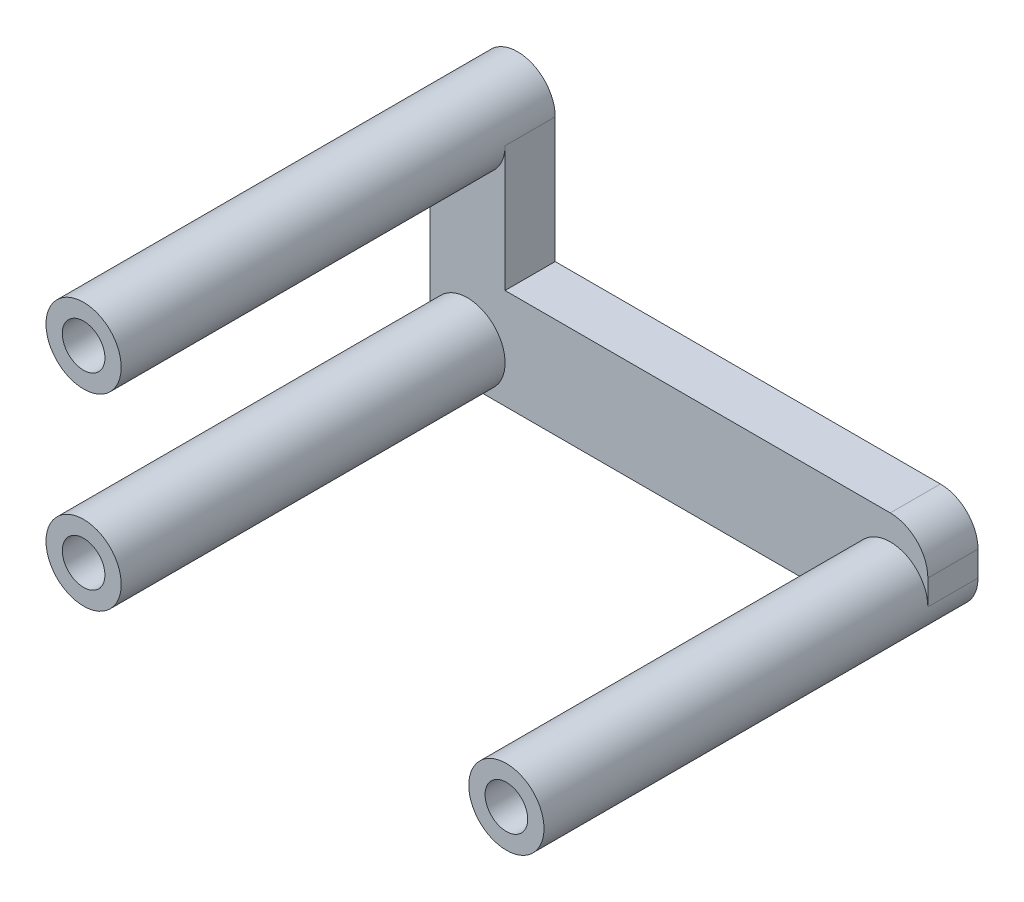
ISO-10303-21;
HEADER;
FILE_DESCRIPTION(('STEP AP214'),'2;1');
FILE_NAME('part.step','',(''),(''),'','','');
FILE_SCHEMA(('AUTOMOTIVE_DESIGN { 1 0 10303 214 1 1 1 1 }'));
ENDSEC;
DATA;
#1=APPLICATION_CONTEXT('core data for automotive mechanical design processes');
#2=APPLICATION_PROTOCOL_DEFINITION('international standard','automotive_design',2000,#1);
#3=PRODUCT_CONTEXT('',#1,'mechanical');
#4=PRODUCT('Part','Part','',(#3));
#5=PRODUCT_RELATED_PRODUCT_CATEGORY('part','',(#4));
#6=PRODUCT_DEFINITION_FORMATION('','',#4);
#7=PRODUCT_DEFINITION_CONTEXT('part definition',#1,'design');
#8=PRODUCT_DEFINITION('design','',#6,#7);
#9=PRODUCT_DEFINITION_SHAPE('','',#8);
#10=(LENGTH_UNIT() NAMED_UNIT(*) SI_UNIT(.MILLI.,.METRE.));
#11=(NAMED_UNIT(*) PLANE_ANGLE_UNIT() SI_UNIT($,.RADIAN.));
#12=(NAMED_UNIT(*) SI_UNIT($,.STERADIAN.) SOLID_ANGLE_UNIT());
#13=UNCERTAINTY_MEASURE_WITH_UNIT(LENGTH_MEASURE(1.E-05),#10,'distance_accuracy_value','');
#14=(GEOMETRIC_REPRESENTATION_CONTEXT(3) GLOBAL_UNCERTAINTY_ASSIGNED_CONTEXT((#13)) GLOBAL_UNIT_ASSIGNED_CONTEXT((#10,
#11,#12)) REPRESENTATION_CONTEXT('',''));
#15=CARTESIAN_POINT('',(0.,0.,0.));
#16=DIRECTION('',(0.,0.,1.));
#17=DIRECTION('',(1.,0.,0.));
#18=AXIS2_PLACEMENT_3D('',#15,#16,#17);
#19=CARTESIAN_POINT('',(-26.7334060127715,18.161,44.1104813742433));
#20=DIRECTION('',(0.,0.,-1.));
#21=DIRECTION('',(-1.,0.,0.));
#22=AXIS2_PLACEMENT_3D('',#19,#20,#21);
#23=CYLINDRICAL_SURFACE('',#22,2.99999999999983);
#24=CARTESIAN_POINT('',(-26.7334060127715,18.161,35.6252000000052));
#25=DIRECTION('',(0.,0.,-1.));
#26=DIRECTION('',(0.,1.,0.));
#27=AXIS2_PLACEMENT_3D('',#24,#25,#26);
#28=CIRCLE('',#27,2.99999999999983);
#29=CARTESIAN_POINT('',(-26.7334060127715,21.1609999999998,35.6252000000052));
#30=VERTEX_POINT('',#29);
#31=EDGE_CURVE('E137',#30,#30,#28,.F.);
#32=ORIENTED_EDGE('',*,*,#31,.F.);
#33=EDGE_LOOP('',(#32));
#34=FACE_BOUND('',#33,.T.);
#35=CARTESIAN_POINT('',(-26.7334060127715,18.161,5.));
#36=DIRECTION('',(0.,0.,-1.));
#37=DIRECTION('',(-1.,0.,0.));
#38=AXIS2_PLACEMENT_3D('',#35,#36,#37);
#39=CIRCLE('',#38,2.99999999999983);
#40=CARTESIAN_POINT('',(-29.7334060127713,18.161,5.));
#41=VERTEX_POINT('',#40);
#42=CARTESIAN_POINT('',(-26.7334060127715,15.1610000000002,5.));
#43=VERTEX_POINT('',#42);
#44=EDGE_CURVE('E140',#41,#43,#39,.T.);
#45=ORIENTED_EDGE('',*,*,#44,.F.);
#46=DIRECTION('',(0.,0.,1.));
#47=VECTOR('',#46,1.);
#48=CARTESIAN_POINT('',(-29.7334060127713,18.161,-15.1554944214034));
#49=LINE('',#48,#47);
#50=CARTESIAN_POINT('',(-29.7334060127713,18.161,1.));
#51=VERTEX_POINT('',#50);
#52=EDGE_CURVE('E203',#51,#41,#49,.T.);
#53=ORIENTED_EDGE('',*,*,#52,.F.);
#54=CARTESIAN_POINT('',(-26.7334060127715,18.161,1.));
#55=DIRECTION('',(0.,0.,-1.));
#56=DIRECTION('',(-1.,0.,0.));
#57=AXIS2_PLACEMENT_3D('',#54,#55,#56);
#58=CIRCLE('',#57,2.99999999999984);
#59=CARTESIAN_POINT('',(-26.7334060127715,15.1610000000002,1.));
#60=VERTEX_POINT('',#59);
#61=EDGE_CURVE('E146',#51,#60,#58,.F.);
#62=ORIENTED_EDGE('',*,*,#61,.T.);
#63=DIRECTION('',(0.,0.,1.));
#64=VECTOR('',#63,1.);
#65=CARTESIAN_POINT('',(-26.7334060127715,15.1610000000002,0.));
#66=LINE('',#65,#64);
#67=EDGE_CURVE('E126',#60,#43,#66,.T.);
#68=ORIENTED_EDGE('',*,*,#67,.T.);
#69=EDGE_LOOP('',(#45,#53,#62,#68));
#70=FACE_BOUND('',#69,.T.);
#71=ADVANCED_FACE('F37',(#34,#70),#23,.T.);
#72=CARTESIAN_POINT('',(9.99690566934757,15.1610000000002,5.));
#73=DIRECTION('',(0.,1.,0.));
#74=DIRECTION('',(-1.,0.,0.));
#75=AXIS2_PLACEMENT_3D('',#72,#73,#74);
#76=PLANE('',#75);
#77=DIRECTION('',(1.,0.,0.));
#78=VECTOR('',#77,1.);
#79=CARTESIAN_POINT('',(9.99690566934757,15.1610000000002,5.));
#80=LINE('',#79,#78);
#81=CARTESIAN_POINT('',(6.99690566934774,15.1610000000002,5.));
#82=VERTEX_POINT('',#81);
#83=EDGE_CURVE('E143',#43,#82,#80,.T.);
#84=ORIENTED_EDGE('',*,*,#83,.F.);
#85=ORIENTED_EDGE('',*,*,#67,.F.);
#86=DIRECTION('',(1.,0.,0.));
#87=VECTOR('',#86,1.);
#88=CARTESIAN_POINT('',(9.99690566934757,15.1610000000002,1.));
#89=LINE('',#88,#87);
#90=CARTESIAN_POINT('',(6.99690566934774,15.1610000000002,1.));
#91=VERTEX_POINT('',#90);
#92=EDGE_CURVE('E142',#60,#91,#89,.T.);
#93=ORIENTED_EDGE('',*,*,#92,.T.);
#94=DIRECTION('',(0.,0.,1.));
#95=VECTOR('',#94,1.);
#96=CARTESIAN_POINT('',(6.99690566934774,15.1610000000002,0.));
#97=LINE('',#96,#95);
#98=EDGE_CURVE('E124',#82,#91,#97,.F.);
#99=ORIENTED_EDGE('',*,*,#98,.F.);
#100=EDGE_LOOP('',(#84,#85,#93,#99));
#101=FACE_BOUND('',#100,.T.);
#102=ADVANCED_FACE('F264',(#101),#76,.F.);
#103=CARTESIAN_POINT('',(0.,0.,5.));
#104=DIRECTION('',(0.,0.,-1.));
#105=DIRECTION('',(-1.,0.,0.));
#106=AXIS2_PLACEMENT_3D('',#103,#104,#105);
#107=PLANE('',#106);
#108=DIRECTION('',(0.,1.,0.));
#109=VECTOR('',#108,1.);
#110=CARTESIAN_POINT('',(9.99690566934757,18.161,5.));
#111=LINE('',#110,#109);
#112=CARTESIAN_POINT('',(9.99690566934757,18.161,5.));
#113=VERTEX_POINT('',#112);
#114=CARTESIAN_POINT('',(9.99690566934757,20.1609999999998,5.));
#115=VERTEX_POINT('',#114);
#116=EDGE_CURVE('E116',#113,#115,#111,.T.);
#117=ORIENTED_EDGE('',*,*,#116,.T.);
#118=CARTESIAN_POINT('',(6.99690566934757,20.1609999999998,5.));
#119=DIRECTION('',(0.,0.,-1.));
#120=DIRECTION('',(-1.,0.,0.));
#121=AXIS2_PLACEMENT_3D('',#118,#119,#120);
#122=CIRCLE('',#121,3.);
#123=CARTESIAN_POINT('',(6.99690566934757,23.1609999999998,5.));
#124=VERTEX_POINT('',#123);
#125=EDGE_CURVE('E11',#115,#124,#122,.F.);
#126=ORIENTED_EDGE('',*,*,#125,.T.);
#127=DIRECTION('',(-1.,0.,0.));
#128=VECTOR('',#127,1.);
#129=CARTESIAN_POINT('',(9.99690566934757,23.1609999999998,5.));
#130=LINE('',#129,#128);
#131=CARTESIAN_POINT('',(-23.7334060127716,23.1609999999998,5.));
#132=VERTEX_POINT('',#131);
#133=EDGE_CURVE('E160',#124,#132,#130,.T.);
#134=ORIENTED_EDGE('',*,*,#133,.T.);
#135=DIRECTION('',(0.,1.,0.));
#136=VECTOR('',#135,1.);
#137=CARTESIAN_POINT('',(-23.7334060127716,33.161,5.));
#138=LINE('',#137,#136);
#139=CARTESIAN_POINT('',(-23.7334060127716,33.161,5.));
#140=VERTEX_POINT('',#139);
#141=EDGE_CURVE('E196',#132,#140,#138,.T.);
#142=ORIENTED_EDGE('',*,*,#141,.T.);
#143=CARTESIAN_POINT('',(-26.7334060127715,33.161,5.));
#144=DIRECTION('',(0.,0.,-1.));
#145=DIRECTION('',(-1.,0.,0.));
#146=AXIS2_PLACEMENT_3D('',#143,#144,#145);
#147=CIRCLE('',#146,2.99999999999983);
#148=CARTESIAN_POINT('',(-29.7334060127713,33.161,5.));
#149=VERTEX_POINT('',#148);
#150=EDGE_CURVE('E193',#140,#149,#147,.T.);
#151=ORIENTED_EDGE('',*,*,#150,.T.);
#152=DIRECTION('',(0.,-1.,0.));
#153=VECTOR('',#152,1.);
#154=CARTESIAN_POINT('',(-29.7334060127713,33.161,5.));
#155=LINE('',#154,#153);
#156=EDGE_CURVE('E197',#149,#41,#155,.T.);
#157=ORIENTED_EDGE('',*,*,#156,.T.);
#158=ORIENTED_EDGE('',*,*,#44,.T.);
#159=ORIENTED_EDGE('',*,*,#83,.T.);
#160=CARTESIAN_POINT('',(6.99690566934774,18.161,5.));
#161=DIRECTION('',(0.,0.,-1.));
#162=DIRECTION('',(-1.,0.,0.));
#163=AXIS2_PLACEMENT_3D('',#160,#161,#162);
#164=CIRCLE('',#163,2.99999999999983);
#165=EDGE_CURVE('E129',#82,#113,#164,.T.);
#166=ORIENTED_EDGE('',*,*,#165,.T.);
#167=EDGE_LOOP('',(#117,#126,#134,#142,#151,#157,#158,#159,#166));
#168=FACE_BOUND('',#167,.T.);
#169=ADVANCED_FACE('F221',(#168),#107,.F.);
#170=CARTESIAN_POINT('',(0.,0.,1.));
#171=DIRECTION('',(0.,0.,-1.));
#172=DIRECTION('',(-1.,0.,0.));
#173=AXIS2_PLACEMENT_3D('',#170,#171,#172);
#174=PLANE('',#173);
#175=CARTESIAN_POINT('',(5.4590000000791,20.161,1.));
#176=DIRECTION('',(0.,0.,-1.));
#177=DIRECTION('',(-1.,0.,0.));
#178=AXIS2_PLACEMENT_3D('',#175,#176,#177);
#179=CIRCLE('',#178,1.70000000007498);
#180=CARTESIAN_POINT('',(3.75900000000413,20.161,1.));
#181=VERTEX_POINT('',#180);
#182=EDGE_CURVE('E230',#181,#181,#179,.T.);
#183=ORIENTED_EDGE('',*,*,#182,.F.);
#184=EDGE_LOOP('',(#183));
#185=FACE_BOUND('',#184,.T.);
#186=CARTESIAN_POINT('',(-15.621,20.161,1.));
#187=DIRECTION('',(0.,0.,-1.));
#188=DIRECTION('',(-1.,0.,0.));
#189=AXIS2_PLACEMENT_3D('',#186,#187,#188);
#190=CIRCLE('',#189,1.7);
#191=CARTESIAN_POINT('',(-17.321,20.161,1.));
#192=VERTEX_POINT('',#191);
#193=EDGE_CURVE('E227',#192,#192,#190,.T.);
#194=ORIENTED_EDGE('',*,*,#193,.F.);
#195=EDGE_LOOP('',(#194));
#196=FACE_BOUND('',#195,.T.);
#197=DIRECTION('',(1.,0.,0.));
#198=VECTOR('',#197,1.);
#199=CARTESIAN_POINT('',(9.99690566934757,23.1609999999998,1.));
#200=LINE('',#199,#198);
#201=CARTESIAN_POINT('',(-23.7334060127716,23.1609999999998,1.));
#202=VERTEX_POINT('',#201);
#203=CARTESIAN_POINT('',(6.99690566934757,23.1609999999998,1.));
#204=VERTEX_POINT('',#203);
#205=EDGE_CURVE('E110',#202,#204,#200,.T.);
#206=ORIENTED_EDGE('',*,*,#205,.T.);
#207=CARTESIAN_POINT('',(6.99690566934757,20.1609999999998,1.));
#208=DIRECTION('',(0.,0.,-1.));
#209=DIRECTION('',(-1.,0.,0.));
#210=AXIS2_PLACEMENT_3D('',#207,#208,#209);
#211=CIRCLE('',#210,3.);
#212=CARTESIAN_POINT('',(9.99690566934757,20.1609999999998,1.));
#213=VERTEX_POINT('',#212);
#214=EDGE_CURVE('E59',#204,#213,#211,.T.);
#215=ORIENTED_EDGE('',*,*,#214,.T.);
#216=DIRECTION('',(0.,-1.,0.));
#217=VECTOR('',#216,1.);
#218=CARTESIAN_POINT('',(9.99690566934757,18.161,1.));
#219=LINE('',#218,#217);
#220=CARTESIAN_POINT('',(9.99690566934757,18.161,1.));
#221=VERTEX_POINT('',#220);
#222=EDGE_CURVE('E105',#213,#221,#219,.T.);
#223=ORIENTED_EDGE('',*,*,#222,.T.);
#224=CARTESIAN_POINT('',(6.99690566934774,18.161,1.));
#225=DIRECTION('',(0.,0.,-1.));
#226=DIRECTION('',(-1.,0.,0.));
#227=AXIS2_PLACEMENT_3D('',#224,#225,#226);
#228=CIRCLE('',#227,2.99999999999983);
#229=EDGE_CURVE('E109',#91,#221,#228,.F.);
#230=ORIENTED_EDGE('',*,*,#229,.F.);
#231=ORIENTED_EDGE('',*,*,#92,.F.);
#232=ORIENTED_EDGE('',*,*,#61,.F.);
#233=DIRECTION('',(0.,-1.,0.));
#234=VECTOR('',#233,1.);
#235=CARTESIAN_POINT('',(-29.7334060127713,33.161,1.));
#236=LINE('',#235,#234);
#237=CARTESIAN_POINT('',(-29.7334060127713,33.161,1.));
#238=VERTEX_POINT('',#237);
#239=EDGE_CURVE('E204',#238,#51,#236,.T.);
#240=ORIENTED_EDGE('',*,*,#239,.F.);
#241=CARTESIAN_POINT('',(-26.7334060127715,33.161,1.));
#242=DIRECTION('',(0.,0.,-1.));
#243=DIRECTION('',(-1.,0.,0.));
#244=AXIS2_PLACEMENT_3D('',#241,#242,#243);
#245=CIRCLE('',#244,2.99999999999983);
#246=CARTESIAN_POINT('',(-23.7334060127716,33.161,1.));
#247=VERTEX_POINT('',#246);
#248=EDGE_CURVE('E191',#238,#247,#245,.T.);
#249=ORIENTED_EDGE('',*,*,#248,.T.);
#250=DIRECTION('',(0.,1.,0.));
#251=VECTOR('',#250,1.);
#252=CARTESIAN_POINT('',(-23.7334060127716,33.161,1.));
#253=LINE('',#252,#251);
#254=EDGE_CURVE('E165',#202,#247,#253,.T.);
#255=ORIENTED_EDGE('',*,*,#254,.F.);
#256=EDGE_LOOP('',(#206,#215,#223,#230,#231,#232,#240,#249,#255));
#257=FACE_BOUND('',#256,.T.);
#258=ADVANCED_FACE('F107',(#185,#196,#257),#174,.T.);
#259=CARTESIAN_POINT('',(-11.1849999999844,-42.5500000000817,35.625200000005));
#260=DIRECTION('',(0.,0.,-1.));
#261=DIRECTION('',(1.,0.,0.));
#262=AXIS2_PLACEMENT_3D('',#259,#260,#261);
#263=PLANE('',#262);
#264=CARTESIAN_POINT('',(-26.7334060127715,18.161,35.6252000000051));
#265=DIRECTION('',(0.,0.,1.));
#266=DIRECTION('',(-1.,0.,0.));
#267=AXIS2_PLACEMENT_3D('',#264,#265,#266);
#268=CIRCLE('',#267,1.7);
#269=CARTESIAN_POINT('',(-28.4334060127715,18.161,35.6252000000051));
#270=VERTEX_POINT('',#269);
#271=EDGE_CURVE('E177',#270,#270,#268,.T.);
#272=ORIENTED_EDGE('',*,*,#271,.F.);
#273=EDGE_LOOP('',(#272));
#274=FACE_BOUND('',#273,.T.);
#275=ORIENTED_EDGE('',*,*,#31,.T.);
#276=EDGE_LOOP('',(#275));
#277=FACE_BOUND('',#276,.T.);
#278=ADVANCED_FACE('F247',(#274,#277),#263,.F.);
#279=CARTESIAN_POINT('',(6.99690566934774,18.161,44.1104813742433));
#280=DIRECTION('',(0.,0.,-1.));
#281=DIRECTION('',(-1.,0.,0.));
#282=AXIS2_PLACEMENT_3D('',#279,#280,#281);
#283=CYLINDRICAL_SURFACE('',#282,2.99999999999983);
#284=DIRECTION('',(0.,0.,-1.));
#285=VECTOR('',#284,1.);
#286=CARTESIAN_POINT('',(9.99690566934757,18.161,39.0988845297453));
#287=LINE('',#286,#285);
#288=EDGE_CURVE('E114',#113,#221,#287,.T.);
#289=ORIENTED_EDGE('',*,*,#288,.F.);
#290=ORIENTED_EDGE('',*,*,#165,.F.);
#291=ORIENTED_EDGE('',*,*,#98,.T.);
#292=ORIENTED_EDGE('',*,*,#229,.T.);
#293=EDGE_LOOP('',(#289,#290,#291,#292));
#294=FACE_BOUND('',#293,.T.);
#295=CARTESIAN_POINT('',(6.99690566934774,18.161,35.6252000000052));
#296=DIRECTION('',(0.,0.,-1.));
#297=DIRECTION('',(0.,1.,0.));
#298=AXIS2_PLACEMENT_3D('',#295,#296,#297);
#299=CIRCLE('',#298,2.99999999999983);
#300=CARTESIAN_POINT('',(6.99690566934774,21.1609999999998,35.6252000000052));
#301=VERTEX_POINT('',#300);
#302=EDGE_CURVE('E125',#301,#301,#299,.F.);
#303=ORIENTED_EDGE('',*,*,#302,.F.);
#304=EDGE_LOOP('',(#303));
#305=FACE_BOUND('',#304,.T.);
#306=ADVANCED_FACE('F122',(#294,#305),#283,.T.);
#307=CARTESIAN_POINT('',(-11.1849999999844,-42.5500000000817,35.625200000005));
#308=DIRECTION('',(0.,0.,-1.));
#309=DIRECTION('',(1.,0.,0.));
#310=AXIS2_PLACEMENT_3D('',#307,#308,#309);
#311=PLANE('',#310);
#312=CARTESIAN_POINT('',(6.99690566934774,18.161,35.6252000000051));
#313=DIRECTION('',(0.,0.,1.));
#314=DIRECTION('',(-1.,0.,0.));
#315=AXIS2_PLACEMENT_3D('',#312,#313,#314);
#316=CIRCLE('',#315,1.7);
#317=CARTESIAN_POINT('',(5.29690566934774,18.161,35.6252000000051));
#318=VERTEX_POINT('',#317);
#319=EDGE_CURVE('E183',#318,#318,#316,.T.);
#320=ORIENTED_EDGE('',*,*,#319,.F.);
#321=EDGE_LOOP('',(#320));
#322=FACE_BOUND('',#321,.T.);
#323=ORIENTED_EDGE('',*,*,#302,.T.);
#324=EDGE_LOOP('',(#323));
#325=FACE_BOUND('',#324,.T.);
#326=ADVANCED_FACE('F301',(#322,#325),#311,.F.);
#327=CARTESIAN_POINT('',(-23.7334060127716,33.161,-15.1554944214034));
#328=DIRECTION('',(1.,0.,0.));
#329=DIRECTION('',(0.,1.,0.));
#330=AXIS2_PLACEMENT_3D('',#327,#328,#329);
#331=PLANE('',#330);
#332=DIRECTION('',(0.,0.,-1.));
#333=VECTOR('',#332,1.);
#334=CARTESIAN_POINT('',(-23.7334060127716,23.1609999999998,39.0988845297453));
#335=LINE('',#334,#333);
#336=EDGE_CURVE('E119',#132,#202,#335,.T.);
#337=ORIENTED_EDGE('',*,*,#336,.T.);
#338=ORIENTED_EDGE('',*,*,#254,.T.);
#339=DIRECTION('',(0.,0.,1.));
#340=VECTOR('',#339,1.);
#341=CARTESIAN_POINT('',(-23.7334060127716,33.161,-15.1554944214034));
#342=LINE('',#341,#340);
#343=EDGE_CURVE('E132',#247,#140,#342,.T.);
#344=ORIENTED_EDGE('',*,*,#343,.T.);
#345=ORIENTED_EDGE('',*,*,#141,.F.);
#346=EDGE_LOOP('',(#337,#338,#344,#345));
#347=FACE_BOUND('',#346,.T.);
#348=ADVANCED_FACE('F215',(#347),#331,.T.);
#349=CARTESIAN_POINT('',(-29.7334060127713,33.161,-15.1554944214034));
#350=DIRECTION('',(-1.,0.,0.));
#351=DIRECTION('',(0.,-1.,0.));
#352=AXIS2_PLACEMENT_3D('',#349,#350,#351);
#353=PLANE('',#352);
#354=DIRECTION('',(0.,0.,1.));
#355=VECTOR('',#354,1.);
#356=CARTESIAN_POINT('',(-29.7334060127713,33.161,-15.1554944214034));
#357=LINE('',#356,#355);
#358=EDGE_CURVE('E200',#238,#149,#357,.T.);
#359=ORIENTED_EDGE('',*,*,#358,.F.);
#360=ORIENTED_EDGE('',*,*,#239,.T.);
#361=ORIENTED_EDGE('',*,*,#52,.T.);
#362=ORIENTED_EDGE('',*,*,#156,.F.);
#363=EDGE_LOOP('',(#359,#360,#361,#362));
#364=FACE_BOUND('',#363,.T.);
#365=ADVANCED_FACE('F314',(#364),#353,.T.);
#366=CARTESIAN_POINT('',(-26.7334060127715,33.161,44.1104813742433));
#367=DIRECTION('',(0.,0.,-1.));
#368=DIRECTION('',(-1.,0.,0.));
#369=AXIS2_PLACEMENT_3D('',#366,#367,#368);
#370=CYLINDRICAL_SURFACE('',#369,2.99999999999983);
#371=CARTESIAN_POINT('',(-26.7334060127715,33.161,35.6252000000052));
#372=DIRECTION('',(0.,0.,-1.));
#373=DIRECTION('',(0.,1.,0.));
#374=AXIS2_PLACEMENT_3D('',#371,#372,#373);
#375=CIRCLE('',#374,2.99999999999983);
#376=CARTESIAN_POINT('',(-26.7334060127715,36.1609999999998,35.6252000000052));
#377=VERTEX_POINT('',#376);
#378=EDGE_CURVE('E173',#377,#377,#375,.F.);
#379=ORIENTED_EDGE('',*,*,#378,.F.);
#380=EDGE_LOOP('',(#379));
#381=FACE_BOUND('',#380,.T.);
#382=ORIENTED_EDGE('',*,*,#150,.F.);
#383=ORIENTED_EDGE('',*,*,#343,.F.);
#384=ORIENTED_EDGE('',*,*,#248,.F.);
#385=ORIENTED_EDGE('',*,*,#358,.T.);
#386=EDGE_LOOP('',(#382,#383,#384,#385));
#387=FACE_BOUND('',#386,.T.);
#388=ADVANCED_FACE('F218',(#381,#387),#370,.T.);
#389=CARTESIAN_POINT('',(-11.1849999999844,-42.5500000000817,35.625200000005));
#390=DIRECTION('',(0.,0.,-1.));
#391=DIRECTION('',(1.,0.,0.));
#392=AXIS2_PLACEMENT_3D('',#389,#390,#391);
#393=PLANE('',#392);
#394=CARTESIAN_POINT('',(-26.7334060127715,33.161,35.6252000000051));
#395=DIRECTION('',(0.,0.,1.));
#396=DIRECTION('',(1.,0.,0.));
#397=AXIS2_PLACEMENT_3D('',#394,#395,#396);
#398=CIRCLE('',#397,1.7);
#399=CARTESIAN_POINT('',(-25.0334060127715,33.161,35.6252000000051));
#400=VERTEX_POINT('',#399);
#401=EDGE_CURVE('E174',#400,#400,#398,.T.);
#402=ORIENTED_EDGE('',*,*,#401,.F.);
#403=EDGE_LOOP('',(#402));
#404=FACE_BOUND('',#403,.T.);
#405=ORIENTED_EDGE('',*,*,#378,.T.);
#406=EDGE_LOOP('',(#405));
#407=FACE_BOUND('',#406,.T.);
#408=ADVANCED_FACE('F327',(#404,#407),#393,.F.);
#409=CARTESIAN_POINT('',(-26.7334060127715,33.161,31.6252000000051));
#410=DIRECTION('',(0.,0.,1.));
#411=DIRECTION('',(1.,0.,0.));
#412=AXIS2_PLACEMENT_3D('',#409,#410,#411);
#413=CYLINDRICAL_SURFACE('',#412,1.7);
#414=CARTESIAN_POINT('',(-26.7334060127715,33.161,31.6252000000051));
#415=DIRECTION('',(0.,0.,1.));
#416=DIRECTION('',(1.,0.,0.));
#417=AXIS2_PLACEMENT_3D('',#414,#415,#416);
#418=CIRCLE('',#417,1.7);
#419=CARTESIAN_POINT('',(-25.0334060127715,33.161,31.6252000000051));
#420=VERTEX_POINT('',#419);
#421=EDGE_CURVE('E170',#420,#420,#418,.T.);
#422=ORIENTED_EDGE('',*,*,#421,.F.);
#423=EDGE_LOOP('',(#422));
#424=FACE_BOUND('',#423,.T.);
#425=ORIENTED_EDGE('',*,*,#401,.T.);
#426=EDGE_LOOP('',(#425));
#427=FACE_BOUND('',#426,.T.);
#428=ADVANCED_FACE('F334',(#424,#427),#413,.F.);
#429=CARTESIAN_POINT('',(-26.7334060127715,33.161,31.6252000000051));
#430=DIRECTION('',(0.,0.,1.));
#431=DIRECTION('',(1.,0.,0.));
#432=AXIS2_PLACEMENT_3D('',#429,#430,#431);
#433=PLANE('',#432);
#434=ORIENTED_EDGE('',*,*,#421,.T.);
#435=EDGE_LOOP('',(#434));
#436=FACE_BOUND('',#435,.T.);
#437=ADVANCED_FACE('F342',(#436),#433,.T.);
#438=CARTESIAN_POINT('',(6.99690566934774,18.161,31.6252000000051));
#439=DIRECTION('',(0.,0.,1.));
#440=DIRECTION('',(1.,0.,0.));
#441=AXIS2_PLACEMENT_3D('',#438,#439,#440);
#442=CYLINDRICAL_SURFACE('',#441,1.7);
#443=CARTESIAN_POINT('',(6.99690566934774,18.161,31.6252000000051));
#444=DIRECTION('',(0.,0.,1.));
#445=DIRECTION('',(-1.,0.,0.));
#446=AXIS2_PLACEMENT_3D('',#443,#444,#445);
#447=CIRCLE('',#446,1.7);
#448=CARTESIAN_POINT('',(5.29690566934774,18.161,31.6252000000051));
#449=VERTEX_POINT('',#448);
#450=EDGE_CURVE('E186',#449,#449,#447,.T.);
#451=ORIENTED_EDGE('',*,*,#450,.F.);
#452=EDGE_LOOP('',(#451));
#453=FACE_BOUND('',#452,.T.);
#454=ORIENTED_EDGE('',*,*,#319,.T.);
#455=EDGE_LOOP('',(#454));
#456=FACE_BOUND('',#455,.T.);
#457=ADVANCED_FACE('F350',(#453,#456),#442,.F.);
#458=CARTESIAN_POINT('',(6.99690566934774,18.161,31.6252000000051));
#459=DIRECTION('',(0.,0.,-1.));
#460=DIRECTION('',(-1.,0.,0.));
#461=AXIS2_PLACEMENT_3D('',#458,#459,#460);
#462=PLANE('',#461);
#463=ORIENTED_EDGE('',*,*,#450,.T.);
#464=EDGE_LOOP('',(#463));
#465=FACE_BOUND('',#464,.T.);
#466=ADVANCED_FACE('F358',(#465),#462,.F.);
#467=CARTESIAN_POINT('',(-26.7334060127715,18.161,31.6252000000051));
#468=DIRECTION('',(0.,0.,1.));
#469=DIRECTION('',(1.,0.,0.));
#470=AXIS2_PLACEMENT_3D('',#467,#468,#469);
#471=CYLINDRICAL_SURFACE('',#470,1.7);
#472=CARTESIAN_POINT('',(-26.7334060127715,18.161,31.6252000000051));
#473=DIRECTION('',(0.,0.,1.));
#474=DIRECTION('',(-1.,0.,0.));
#475=AXIS2_PLACEMENT_3D('',#472,#473,#474);
#476=CIRCLE('',#475,1.7);
#477=CARTESIAN_POINT('',(-28.4334060127715,18.161,31.6252000000051));
#478=VERTEX_POINT('',#477);
#479=EDGE_CURVE('E180',#478,#478,#476,.T.);
#480=ORIENTED_EDGE('',*,*,#479,.F.);
#481=EDGE_LOOP('',(#480));
#482=FACE_BOUND('',#481,.T.);
#483=ORIENTED_EDGE('',*,*,#271,.T.);
#484=EDGE_LOOP('',(#483));
#485=FACE_BOUND('',#484,.T.);
#486=ADVANCED_FACE('F366',(#482,#485),#471,.F.);
#487=CARTESIAN_POINT('',(-26.7334060127715,18.161,31.6252000000051));
#488=DIRECTION('',(0.,0.,-1.));
#489=DIRECTION('',(-1.,0.,0.));
#490=AXIS2_PLACEMENT_3D('',#487,#488,#489);
#491=PLANE('',#490);
#492=ORIENTED_EDGE('',*,*,#479,.T.);
#493=EDGE_LOOP('',(#492));
#494=FACE_BOUND('',#493,.T.);
#495=ADVANCED_FACE('F374',(#494),#491,.F.);
#496=CARTESIAN_POINT('',(9.99690566934757,18.161,39.0988845297453));
#497=DIRECTION('',(1.,0.,0.));
#498=DIRECTION('',(0.,0.,-1.));
#499=AXIS2_PLACEMENT_3D('',#496,#497,#498);
#500=PLANE('',#499);
#501=ORIENTED_EDGE('',*,*,#222,.F.);
#502=DIRECTION('',(0.,0.,-1.));
#503=VECTOR('',#502,1.);
#504=CARTESIAN_POINT('',(9.99690566934757,20.1609999999998,39.0988845297453));
#505=LINE('',#504,#503);
#506=EDGE_CURVE('E45',#213,#115,#505,.F.);
#507=ORIENTED_EDGE('',*,*,#506,.T.);
#508=ORIENTED_EDGE('',*,*,#116,.F.);
#509=ORIENTED_EDGE('',*,*,#288,.T.);
#510=EDGE_LOOP('',(#501,#507,#508,#509));
#511=FACE_BOUND('',#510,.T.);
#512=ADVANCED_FACE('F115',(#511),#500,.T.);
#513=CARTESIAN_POINT('',(9.99690566934757,23.1609999999998,39.0988845297453));
#514=DIRECTION('',(0.,1.,0.));
#515=DIRECTION('',(0.,0.,1.));
#516=AXIS2_PLACEMENT_3D('',#513,#514,#515);
#517=PLANE('',#516);
#518=ORIENTED_EDGE('',*,*,#133,.F.);
#519=DIRECTION('',(0.,0.,-1.));
#520=VECTOR('',#519,1.);
#521=CARTESIAN_POINT('',(6.99690566934757,23.1609999999998,39.0988845297453));
#522=LINE('',#521,#520);
#523=EDGE_CURVE('E151',#124,#204,#522,.T.);
#524=ORIENTED_EDGE('',*,*,#523,.T.);
#525=ORIENTED_EDGE('',*,*,#205,.F.);
#526=ORIENTED_EDGE('',*,*,#336,.F.);
#527=EDGE_LOOP('',(#518,#524,#525,#526));
#528=FACE_BOUND('',#527,.T.);
#529=ADVANCED_FACE('F157',(#528),#517,.T.);
#530=CARTESIAN_POINT('',(-15.621,20.161,3.));
#531=DIRECTION('',(0.,0.,-1.));
#532=DIRECTION('',(-1.,0.,0.));
#533=AXIS2_PLACEMENT_3D('',#530,#531,#532);
#534=CYLINDRICAL_SURFACE('',#533,1.7);
#535=CARTESIAN_POINT('',(-15.621,20.161,3.));
#536=DIRECTION('',(0.,0.,-1.));
#537=DIRECTION('',(-1.,0.,0.));
#538=AXIS2_PLACEMENT_3D('',#535,#536,#537);
#539=CIRCLE('',#538,1.7);
#540=CARTESIAN_POINT('',(-17.321,20.161,3.));
#541=VERTEX_POINT('',#540);
#542=EDGE_CURVE('E224',#541,#541,#539,.T.);
#543=ORIENTED_EDGE('',*,*,#542,.F.);
#544=EDGE_LOOP('',(#543));
#545=FACE_BOUND('',#544,.T.);
#546=ORIENTED_EDGE('',*,*,#193,.T.);
#547=EDGE_LOOP('',(#546));
#548=FACE_BOUND('',#547,.T.);
#549=ADVANCED_FACE('F251',(#545,#548),#534,.F.);
#550=CARTESIAN_POINT('',(-15.621,20.161,3.));
#551=DIRECTION('',(0.,0.,-1.));
#552=DIRECTION('',(-1.,0.,0.));
#553=AXIS2_PLACEMENT_3D('',#550,#551,#552);
#554=PLANE('',#553);
#555=ORIENTED_EDGE('',*,*,#542,.T.);
#556=EDGE_LOOP('',(#555));
#557=FACE_BOUND('',#556,.T.);
#558=ADVANCED_FACE('F241',(#557),#554,.T.);
#559=CARTESIAN_POINT('',(5.4590000000791,20.161,3.));
#560=DIRECTION('',(0.,0.,-1.));
#561=DIRECTION('',(-1.,0.,0.));
#562=AXIS2_PLACEMENT_3D('',#559,#560,#561);
#563=CYLINDRICAL_SURFACE('',#562,1.70000000007498);
#564=CARTESIAN_POINT('',(5.4590000000791,20.161,3.));
#565=DIRECTION('',(0.,0.,-1.));
#566=DIRECTION('',(-1.,0.,0.));
#567=AXIS2_PLACEMENT_3D('',#564,#565,#566);
#568=CIRCLE('',#567,1.70000000007498);
#569=CARTESIAN_POINT('',(3.75900000000413,20.161,3.));
#570=VERTEX_POINT('',#569);
#571=EDGE_CURVE('E111',#570,#570,#568,.T.);
#572=ORIENTED_EDGE('',*,*,#571,.F.);
#573=EDGE_LOOP('',(#572));
#574=FACE_BOUND('',#573,.T.);
#575=ORIENTED_EDGE('',*,*,#182,.T.);
#576=EDGE_LOOP('',(#575));
#577=FACE_BOUND('',#576,.T.);
#578=ADVANCED_FACE('F238',(#574,#577),#563,.F.);
#579=CARTESIAN_POINT('',(5.4590000000791,20.161,3.));
#580=DIRECTION('',(0.,0.,-1.));
#581=DIRECTION('',(-1.,0.,0.));
#582=AXIS2_PLACEMENT_3D('',#579,#580,#581);
#583=PLANE('',#582);
#584=ORIENTED_EDGE('',*,*,#571,.T.);
#585=EDGE_LOOP('',(#584));
#586=FACE_BOUND('',#585,.T.);
#587=ADVANCED_FACE('F236',(#586),#583,.T.);
#588=CARTESIAN_POINT('',(6.99690566934757,20.1609999999998,39.0988845297453));
#589=DIRECTION('',(0.,0.,-1.));
#590=DIRECTION('',(-1.,0.,0.));
#591=AXIS2_PLACEMENT_3D('',#588,#589,#590);
#592=CYLINDRICAL_SURFACE('',#591,3.);
#593=ORIENTED_EDGE('',*,*,#125,.F.);
#594=ORIENTED_EDGE('',*,*,#506,.F.);
#595=ORIENTED_EDGE('',*,*,#214,.F.);
#596=ORIENTED_EDGE('',*,*,#523,.F.);
#597=EDGE_LOOP('',(#593,#594,#595,#596));
#598=FACE_BOUND('',#597,.T.);
#599=ADVANCED_FACE('F39',(#598),#592,.T.);
#600=CLOSED_SHELL('',(#71,#102,#169,#258,#278,#306,#326,#348,#365,#388,#408,#428,#437,#457,#466,
#486,#495,#512,#529,#549,#558,#578,#587,#599));
#601=MANIFOLD_SOLID_BREP('B2',#600);
#602=ADVANCED_BREP_SHAPE_REPRESENTATION('',(#18,#601),#14);
#603=SHAPE_DEFINITION_REPRESENTATION(#9,#602);
ENDSEC;
END-ISO-10303-21;
